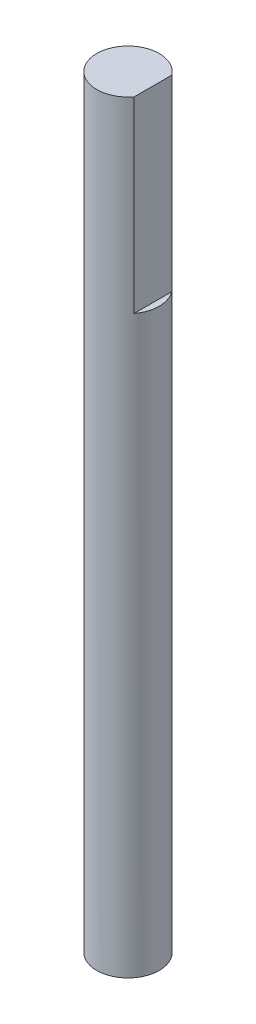
ISO-10303-21;
HEADER;
FILE_DESCRIPTION(('STEP AP214'),'2;1');
FILE_NAME('part.step','',(''),(''),'','','');
FILE_SCHEMA(('AUTOMOTIVE_DESIGN { 1 0 10303 214 1 1 1 1 }'));
ENDSEC;
DATA;
#1=APPLICATION_CONTEXT('core data for automotive mechanical design processes');
#2=APPLICATION_PROTOCOL_DEFINITION('international standard','automotive_design',2000,#1);
#3=PRODUCT_CONTEXT('',#1,'mechanical');
#4=PRODUCT('Part','Part','',(#3));
#5=PRODUCT_RELATED_PRODUCT_CATEGORY('part','',(#4));
#6=PRODUCT_DEFINITION_FORMATION('','',#4);
#7=PRODUCT_DEFINITION_CONTEXT('part definition',#1,'design');
#8=PRODUCT_DEFINITION('design','',#6,#7);
#9=PRODUCT_DEFINITION_SHAPE('','',#8);
#10=(LENGTH_UNIT() NAMED_UNIT(*) SI_UNIT(.MILLI.,.METRE.));
#11=(NAMED_UNIT(*) PLANE_ANGLE_UNIT() SI_UNIT($,.RADIAN.));
#12=(NAMED_UNIT(*) SI_UNIT($,.STERADIAN.) SOLID_ANGLE_UNIT());
#13=UNCERTAINTY_MEASURE_WITH_UNIT(LENGTH_MEASURE(1.E-05),#10,'distance_accuracy_value','');
#14=(GEOMETRIC_REPRESENTATION_CONTEXT(3) GLOBAL_UNCERTAINTY_ASSIGNED_CONTEXT((#13)) GLOBAL_UNIT_ASSIGNED_CONTEXT((#10,
#11,#12)) REPRESENTATION_CONTEXT('',''));
#15=CARTESIAN_POINT('',(0.,0.,0.));
#16=DIRECTION('',(0.,0.,1.));
#17=DIRECTION('',(1.,0.,0.));
#18=AXIS2_PLACEMENT_3D('',#15,#16,#17);
#19=CARTESIAN_POINT('',(0.,15.,0.));
#20=DIRECTION('',(0.,-1.,0.));
#21=DIRECTION('',(0.,0.,-1.));
#22=AXIS2_PLACEMENT_3D('',#19,#20,#21);
#23=CYLINDRICAL_SURFACE('',#22,2.5);
#24=DIRECTION('',(0.,-1.,0.));
#25=VECTOR('',#24,1.);
#26=CARTESIAN_POINT('',(2.,15.,-1.5));
#27=LINE('',#26,#25);
#28=CARTESIAN_POINT('',(2.,15.,-1.5));
#29=VERTEX_POINT('',#28);
#30=CARTESIAN_POINT('',(2.,0.,-1.5));
#31=VERTEX_POINT('',#30);
#32=EDGE_CURVE('E48',#29,#31,#27,.T.);
#33=ORIENTED_EDGE('',*,*,#32,.T.);
#34=CARTESIAN_POINT('',(0.,0.,0.));
#35=DIRECTION('',(0.,1.,0.));
#36=DIRECTION('',(0.,0.,1.));
#37=AXIS2_PLACEMENT_3D('',#34,#35,#36);
#38=CIRCLE('',#37,2.5);
#39=CARTESIAN_POINT('',(2.,0.,1.5));
#40=VERTEX_POINT('',#39);
#41=EDGE_CURVE('E65',#40,#31,#38,.T.);
#42=ORIENTED_EDGE('',*,*,#41,.F.);
#43=DIRECTION('',(0.,-1.,0.));
#44=VECTOR('',#43,1.);
#45=CARTESIAN_POINT('',(2.,15.,1.5));
#46=LINE('',#45,#44);
#47=CARTESIAN_POINT('',(2.,15.,1.5));
#48=VERTEX_POINT('',#47);
#49=EDGE_CURVE('E11',#48,#40,#46,.T.);
#50=ORIENTED_EDGE('',*,*,#49,.F.);
#51=CARTESIAN_POINT('',(0.,15.,0.));
#52=DIRECTION('',(0.,1.,0.));
#53=DIRECTION('',(0.,0.,1.));
#54=AXIS2_PLACEMENT_3D('',#51,#52,#53);
#55=CIRCLE('',#54,2.5);
#56=EDGE_CURVE('E77',#29,#48,#55,.T.);
#57=ORIENTED_EDGE('',*,*,#56,.F.);
#58=EDGE_LOOP('',(#33,#42,#50,#57));
#59=FACE_BOUND('',#58,.T.);
#60=CARTESIAN_POINT('',(0.,-46.,0.));
#61=DIRECTION('',(0.,1.,0.));
#62=DIRECTION('',(0.,0.,1.));
#63=AXIS2_PLACEMENT_3D('',#60,#61,#62);
#64=CIRCLE('',#63,2.5);
#65=CARTESIAN_POINT('',(0.,-46.,2.5));
#66=VERTEX_POINT('',#65);
#67=EDGE_CURVE('E71',#66,#66,#64,.T.);
#68=ORIENTED_EDGE('',*,*,#67,.T.);
#69=EDGE_LOOP('',(#68));
#70=FACE_BOUND('',#69,.T.);
#71=ADVANCED_FACE('F39',(#59,#70),#23,.T.);
#72=CARTESIAN_POINT('',(2.,15.,-1.5));
#73=DIRECTION('',(-1.,0.,0.));
#74=DIRECTION('',(0.,0.,1.));
#75=AXIS2_PLACEMENT_3D('',#72,#73,#74);
#76=PLANE('',#75);
#77=DIRECTION('',(0.,0.,-1.));
#78=VECTOR('',#77,1.);
#79=CARTESIAN_POINT('',(2.,0.,-1.5));
#80=LINE('',#79,#78);
#81=EDGE_CURVE('E63',#40,#31,#80,.T.);
#82=ORIENTED_EDGE('',*,*,#81,.T.);
#83=ORIENTED_EDGE('',*,*,#32,.F.);
#84=DIRECTION('',(0.,0.,-1.));
#85=VECTOR('',#84,1.);
#86=CARTESIAN_POINT('',(2.,15.,-1.5));
#87=LINE('',#86,#85);
#88=EDGE_CURVE('E54',#48,#29,#87,.T.);
#89=ORIENTED_EDGE('',*,*,#88,.F.);
#90=ORIENTED_EDGE('',*,*,#49,.T.);
#91=EDGE_LOOP('',(#82,#83,#89,#90));
#92=FACE_BOUND('',#91,.T.);
#93=ADVANCED_FACE('F74',(#92),#76,.F.);
#94=CARTESIAN_POINT('',(0.,15.,0.));
#95=DIRECTION('',(0.,1.,0.));
#96=DIRECTION('',(0.,0.,1.));
#97=AXIS2_PLACEMENT_3D('',#94,#95,#96);
#98=PLANE('',#97);
#99=ORIENTED_EDGE('',*,*,#56,.T.);
#100=ORIENTED_EDGE('',*,*,#88,.T.);
#101=EDGE_LOOP('',(#99,#100));
#102=FACE_BOUND('',#101,.T.);
#103=ADVANCED_FACE('F96',(#102),#98,.T.);
#104=CARTESIAN_POINT('',(0.,0.,0.));
#105=DIRECTION('',(0.,1.,0.));
#106=DIRECTION('',(0.,0.,1.));
#107=AXIS2_PLACEMENT_3D('',#104,#105,#106);
#108=PLANE('',#107);
#109=ORIENTED_EDGE('',*,*,#81,.F.);
#110=ORIENTED_EDGE('',*,*,#41,.T.);
#111=EDGE_LOOP('',(#109,#110));
#112=FACE_BOUND('',#111,.T.);
#113=ADVANCED_FACE('F66',(#112),#108,.T.);
#114=CARTESIAN_POINT('',(0.,-46.,0.));
#115=DIRECTION('',(0.,1.,0.));
#116=DIRECTION('',(0.,0.,1.));
#117=AXIS2_PLACEMENT_3D('',#114,#115,#116);
#118=PLANE('',#117);
#119=ORIENTED_EDGE('',*,*,#67,.F.);
#120=EDGE_LOOP('',(#119));
#121=FACE_BOUND('',#120,.T.);
#122=ADVANCED_FACE('F90',(#121),#118,.F.);
#123=CLOSED_SHELL('',(#71,#93,#103,#113,#122));
#124=MANIFOLD_SOLID_BREP('B2',#123);
#125=ADVANCED_BREP_SHAPE_REPRESENTATION('',(#18,#124),#14);
#126=SHAPE_DEFINITION_REPRESENTATION(#9,#125);
ENDSEC;
END-ISO-10303-21;
